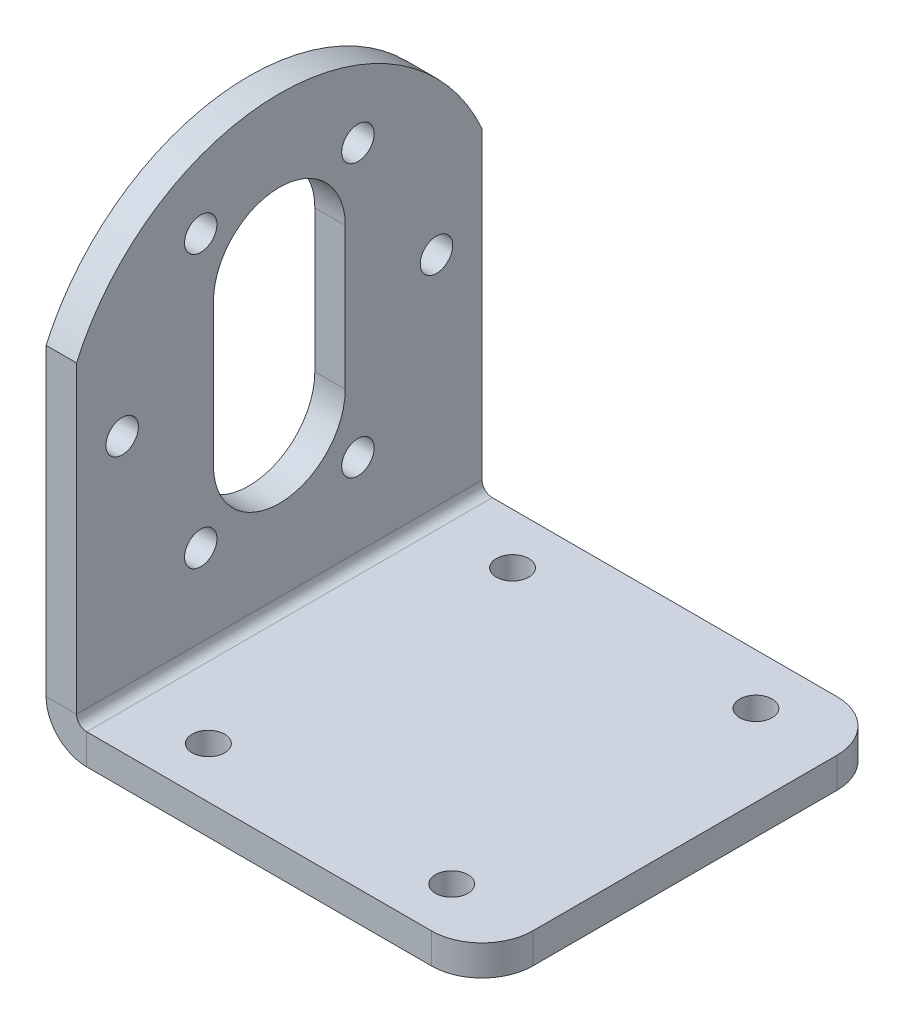
ISO-10303-21;
HEADER;
FILE_DESCRIPTION(('STEP AP214'),'2;1');
FILE_NAME('part.step','',(''),(''),'','','');
FILE_SCHEMA(('AUTOMOTIVE_DESIGN { 1 0 10303 214 1 1 1 1 }'));
ENDSEC;
DATA;
#1=APPLICATION_CONTEXT('core data for automotive mechanical design processes');
#2=APPLICATION_PROTOCOL_DEFINITION('international standard','automotive_design',2000,#1);
#3=PRODUCT_CONTEXT('',#1,'mechanical');
#4=PRODUCT('Part','Part','',(#3));
#5=PRODUCT_RELATED_PRODUCT_CATEGORY('part','',(#4));
#6=PRODUCT_DEFINITION_FORMATION('','',#4);
#7=PRODUCT_DEFINITION_CONTEXT('part definition',#1,'design');
#8=PRODUCT_DEFINITION('design','',#6,#7);
#9=PRODUCT_DEFINITION_SHAPE('','',#8);
#10=(LENGTH_UNIT() NAMED_UNIT(*) SI_UNIT(.MILLI.,.METRE.));
#11=(NAMED_UNIT(*) PLANE_ANGLE_UNIT() SI_UNIT($,.RADIAN.));
#12=(NAMED_UNIT(*) SI_UNIT($,.STERADIAN.) SOLID_ANGLE_UNIT());
#13=UNCERTAINTY_MEASURE_WITH_UNIT(LENGTH_MEASURE(1.E-05),#10,'distance_accuracy_value','');
#14=(GEOMETRIC_REPRESENTATION_CONTEXT(3) GLOBAL_UNCERTAINTY_ASSIGNED_CONTEXT((#13)) GLOBAL_UNIT_ASSIGNED_CONTEXT((#10,
#11,#12)) REPRESENTATION_CONTEXT('',''));
#15=CARTESIAN_POINT('',(0.,0.,0.));
#16=DIRECTION('',(0.,0.,1.));
#17=DIRECTION('',(1.,0.,0.));
#18=AXIS2_PLACEMENT_3D('',#15,#16,#17);
#19=CARTESIAN_POINT('',(7.99999999999999,44.,5.));
#20=DIRECTION('',(0.,-1.,0.));
#21=DIRECTION('',(0.,0.,-1.));
#22=AXIS2_PLACEMENT_3D('',#19,#20,#21);
#23=CYLINDRICAL_SURFACE('',#22,1.6);
#24=CARTESIAN_POINT('',(7.99999999999999,0.,5.));
#25=DIRECTION('',(0.,1.,0.));
#26=DIRECTION('',(0.,0.,1.));
#27=AXIS2_PLACEMENT_3D('',#24,#25,#26);
#28=CIRCLE('',#27,1.6);
#29=CARTESIAN_POINT('',(7.99999999999999,0.,6.6));
#30=VERTEX_POINT('',#29);
#31=EDGE_CURVE('E278',#30,#30,#28,.T.);
#32=ORIENTED_EDGE('',*,*,#31,.T.);
#33=EDGE_LOOP('',(#32));
#34=FACE_BOUND('',#33,.T.);
#35=CARTESIAN_POINT('',(7.99999999999999,-3.,5.));
#36=DIRECTION('',(0.,-1.,0.));
#37=DIRECTION('',(0.,0.,-1.));
#38=AXIS2_PLACEMENT_3D('',#35,#36,#37);
#39=CIRCLE('',#38,1.6);
#40=CARTESIAN_POINT('',(7.99999999999999,-3.,3.40000000000001));
#41=VERTEX_POINT('',#40);
#42=EDGE_CURVE('E281',#41,#41,#39,.T.);
#43=ORIENTED_EDGE('',*,*,#42,.T.);
#44=EDGE_LOOP('',(#43));
#45=FACE_BOUND('',#44,.T.);
#46=ADVANCED_FACE('F57',(#34,#45),#23,.F.);
#47=CARTESIAN_POINT('',(7.99999999999999,44.,35.));
#48=DIRECTION('',(0.,-1.,0.));
#49=DIRECTION('',(0.,0.,-1.));
#50=AXIS2_PLACEMENT_3D('',#47,#48,#49);
#51=CYLINDRICAL_SURFACE('',#50,1.6);
#52=CARTESIAN_POINT('',(7.99999999999999,0.,35.));
#53=DIRECTION('',(0.,1.,0.));
#54=DIRECTION('',(0.,0.,1.));
#55=AXIS2_PLACEMENT_3D('',#52,#53,#54);
#56=CIRCLE('',#55,1.6);
#57=CARTESIAN_POINT('',(7.99999999999999,0.,36.6));
#58=VERTEX_POINT('',#57);
#59=EDGE_CURVE('E267',#58,#58,#56,.T.);
#60=ORIENTED_EDGE('',*,*,#59,.T.);
#61=EDGE_LOOP('',(#60));
#62=FACE_BOUND('',#61,.T.);
#63=CARTESIAN_POINT('',(7.99999999999999,-3.,35.));
#64=DIRECTION('',(0.,-1.,0.));
#65=DIRECTION('',(0.,0.,-1.));
#66=AXIS2_PLACEMENT_3D('',#63,#64,#65);
#67=CIRCLE('',#66,1.6);
#68=CARTESIAN_POINT('',(7.99999999999999,-3.,33.4));
#69=VERTEX_POINT('',#68);
#70=EDGE_CURVE('E275',#69,#69,#67,.T.);
#71=ORIENTED_EDGE('',*,*,#70,.T.);
#72=EDGE_LOOP('',(#71));
#73=FACE_BOUND('',#72,.T.);
#74=ADVANCED_FACE('F363',(#62,#73),#51,.F.);
#75=CARTESIAN_POINT('',(0.,0.,40.));
#76=DIRECTION('',(1.,0.,0.));
#77=DIRECTION('',(0.,0.,-1.));
#78=AXIS2_PLACEMENT_3D('',#75,#76,#77);
#79=PLANE('',#78);
#80=CARTESIAN_POINT('',(0.,22.5,4.5));
#81=DIRECTION('',(1.,0.,0.));
#82=DIRECTION('',(0.,0.,-1.));
#83=AXIS2_PLACEMENT_3D('',#80,#81,#82);
#84=CIRCLE('',#83,1.6);
#85=CARTESIAN_POINT('',(0.,22.5,2.9));
#86=VERTEX_POINT('',#85);
#87=EDGE_CURVE('E680',#86,#86,#84,.T.);
#88=ORIENTED_EDGE('',*,*,#87,.F.);
#89=EDGE_LOOP('',(#88));
#90=FACE_BOUND('',#89,.T.);
#91=CARTESIAN_POINT('',(0.,35.9233937586588,12.25));
#92=DIRECTION('',(1.,0.,0.));
#93=DIRECTION('',(0.,0.,-1.));
#94=AXIS2_PLACEMENT_3D('',#91,#92,#93);
#95=CIRCLE('',#94,1.59999999999995);
#96=CARTESIAN_POINT('',(0.,35.9233937586588,10.6500000000001));
#97=VERTEX_POINT('',#96);
#98=EDGE_CURVE('E684',#97,#97,#95,.T.);
#99=ORIENTED_EDGE('',*,*,#98,.F.);
#100=EDGE_LOOP('',(#99));
#101=FACE_BOUND('',#100,.T.);
#102=CARTESIAN_POINT('',(0.,35.9233937586589,27.7499999999999));
#103=DIRECTION('',(1.,0.,0.));
#104=DIRECTION('',(0.,0.,-1.));
#105=AXIS2_PLACEMENT_3D('',#102,#103,#104);
#106=CIRCLE('',#105,1.6);
#107=CARTESIAN_POINT('',(0.,35.9233937586589,26.1499999999999));
#108=VERTEX_POINT('',#107);
#109=EDGE_CURVE('E688',#108,#108,#106,.T.);
#110=ORIENTED_EDGE('',*,*,#109,.F.);
#111=EDGE_LOOP('',(#110));
#112=FACE_BOUND('',#111,.T.);
#113=CARTESIAN_POINT('',(0.,22.5000000000001,35.5));
#114=DIRECTION('',(1.,0.,0.));
#115=DIRECTION('',(0.,0.,-1.));
#116=AXIS2_PLACEMENT_3D('',#113,#114,#115);
#117=CIRCLE('',#116,1.6);
#118=CARTESIAN_POINT('',(0.,22.5000000000001,33.9));
#119=VERTEX_POINT('',#118);
#120=EDGE_CURVE('E692',#119,#119,#117,.T.);
#121=ORIENTED_EDGE('',*,*,#120,.F.);
#122=EDGE_LOOP('',(#121));
#123=FACE_BOUND('',#122,.T.);
#124=CARTESIAN_POINT('',(0.,9.07660624134124,27.7500000000001));
#125=DIRECTION('',(1.,0.,0.));
#126=DIRECTION('',(0.,0.,-1.));
#127=AXIS2_PLACEMENT_3D('',#124,#125,#126);
#128=CIRCLE('',#127,1.6);
#129=CARTESIAN_POINT('',(0.,9.07660624134124,26.1500000000001));
#130=VERTEX_POINT('',#129);
#131=EDGE_CURVE('E696',#130,#130,#128,.T.);
#132=ORIENTED_EDGE('',*,*,#131,.F.);
#133=EDGE_LOOP('',(#132));
#134=FACE_BOUND('',#133,.T.);
#135=CARTESIAN_POINT('',(0.,9.07660624134118,12.25));
#136=DIRECTION('',(1.,0.,0.));
#137=DIRECTION('',(0.,0.,-1.));
#138=AXIS2_PLACEMENT_3D('',#135,#136,#137);
#139=CIRCLE('',#138,1.6);
#140=CARTESIAN_POINT('',(0.,9.07660624134118,10.65));
#141=VERTEX_POINT('',#140);
#142=EDGE_CURVE('E700',#141,#141,#139,.T.);
#143=ORIENTED_EDGE('',*,*,#142,.F.);
#144=EDGE_LOOP('',(#143));
#145=FACE_BOUND('',#144,.T.);
#146=CARTESIAN_POINT('',(0.,29.5,20.));
#147=DIRECTION('',(1.,0.,0.));
#148=DIRECTION('',(0.,0.,-1.));
#149=AXIS2_PLACEMENT_3D('',#146,#147,#148);
#150=CIRCLE('',#149,6.5);
#151=CARTESIAN_POINT('',(0.,29.5,13.5));
#152=VERTEX_POINT('',#151);
#153=CARTESIAN_POINT('',(0.,29.5,26.5));
#154=VERTEX_POINT('',#153);
#155=EDGE_CURVE('E200',#152,#154,#150,.T.);
#156=ORIENTED_EDGE('',*,*,#155,.F.);
#157=DIRECTION('',(0.,1.,0.));
#158=VECTOR('',#157,1.);
#159=CARTESIAN_POINT('',(0.,0.,13.5));
#160=LINE('',#159,#158);
#161=CARTESIAN_POINT('',(0.,15.5,13.5));
#162=VERTEX_POINT('',#161);
#163=EDGE_CURVE('E193',#162,#152,#160,.T.);
#164=ORIENTED_EDGE('',*,*,#163,.F.);
#165=CARTESIAN_POINT('',(0.,15.5,20.));
#166=DIRECTION('',(1.,0.,0.));
#167=DIRECTION('',(0.,0.,-1.));
#168=AXIS2_PLACEMENT_3D('',#165,#166,#167);
#169=CIRCLE('',#168,6.5);
#170=CARTESIAN_POINT('',(0.,15.5,26.5));
#171=VERTEX_POINT('',#170);
#172=EDGE_CURVE('E168',#171,#162,#169,.T.);
#173=ORIENTED_EDGE('',*,*,#172,.F.);
#174=DIRECTION('',(0.,-1.,0.));
#175=VECTOR('',#174,1.);
#176=CARTESIAN_POINT('',(0.,0.,26.5));
#177=LINE('',#176,#175);
#178=EDGE_CURVE('E198',#154,#171,#177,.T.);
#179=ORIENTED_EDGE('',*,*,#178,.F.);
#180=EDGE_LOOP('',(#156,#164,#173,#179));
#181=FACE_BOUND('',#180,.T.);
#182=CARTESIAN_POINT('',(0.,22.1134778286727,20.));
#183=DIRECTION('',(1.,0.,0.));
#184=DIRECTION('',(0.,0.,-1.));
#185=AXIS2_PLACEMENT_3D('',#182,#183,#184);
#186=CIRCLE('',#185,21.8865221713273);
#187=CARTESIAN_POINT('',(0.,31.0027889806126,40.));
#188=VERTEX_POINT('',#187);
#189=CARTESIAN_POINT('',(0.,31.0027889806126,0.));
#190=VERTEX_POINT('',#189);
#191=EDGE_CURVE('E206',#188,#190,#186,.F.);
#192=ORIENTED_EDGE('',*,*,#191,.F.);
#193=DIRECTION('',(0.,-1.,0.));
#194=VECTOR('',#193,1.);
#195=CARTESIAN_POINT('',(0.,0.,40.));
#196=LINE('',#195,#194);
#197=CARTESIAN_POINT('',(0.,1.,40.));
#198=VERTEX_POINT('',#197);
#199=EDGE_CURVE('E217',#188,#198,#196,.T.);
#200=ORIENTED_EDGE('',*,*,#199,.T.);
#201=DIRECTION('',(0.,0.,-1.));
#202=VECTOR('',#201,1.);
#203=CARTESIAN_POINT('',(0.,1.,40.));
#204=LINE('',#203,#202);
#205=CARTESIAN_POINT('',(0.,1.,0.));
#206=VERTEX_POINT('',#205);
#207=EDGE_CURVE('E244',#198,#206,#204,.T.);
#208=ORIENTED_EDGE('',*,*,#207,.T.);
#209=DIRECTION('',(0.,-1.,0.));
#210=VECTOR('',#209,1.);
#211=CARTESIAN_POINT('',(0.,0.,0.));
#212=LINE('',#211,#210);
#213=EDGE_CURVE('E233',#190,#206,#212,.T.);
#214=ORIENTED_EDGE('',*,*,#213,.F.);
#215=EDGE_LOOP('',(#192,#200,#208,#214));
#216=FACE_BOUND('',#215,.T.);
#217=ADVANCED_FACE('F337',(#90,#101,#112,#123,#134,#145,#181,#216),#79,.T.);
#218=CARTESIAN_POINT('',(-3.,0.,40.));
#219=DIRECTION('',(1.,0.,0.));
#220=DIRECTION('',(0.,0.,-1.));
#221=AXIS2_PLACEMENT_3D('',#218,#219,#220);
#222=PLANE('',#221);
#223=CARTESIAN_POINT('',(-3.,22.5,4.5));
#224=DIRECTION('',(-1.,0.,0.));
#225=DIRECTION('',(0.,0.,1.));
#226=AXIS2_PLACEMENT_3D('',#223,#224,#225);
#227=CIRCLE('',#226,1.6);
#228=CARTESIAN_POINT('',(-3.,22.5,6.1));
#229=VERTEX_POINT('',#228);
#230=EDGE_CURVE('E711',#229,#229,#227,.T.);
#231=ORIENTED_EDGE('',*,*,#230,.F.);
#232=EDGE_LOOP('',(#231));
#233=FACE_BOUND('',#232,.T.);
#234=CARTESIAN_POINT('',(-3.,35.9233937586588,12.25));
#235=DIRECTION('',(-1.,0.,0.));
#236=DIRECTION('',(0.,0.,1.));
#237=AXIS2_PLACEMENT_3D('',#234,#235,#236);
#238=CIRCLE('',#237,1.59999999999995);
#239=CARTESIAN_POINT('',(-3.,35.9233937586588,13.85));
#240=VERTEX_POINT('',#239);
#241=EDGE_CURVE('E271',#240,#240,#238,.T.);
#242=ORIENTED_EDGE('',*,*,#241,.F.);
#243=EDGE_LOOP('',(#242));
#244=FACE_BOUND('',#243,.T.);
#245=CARTESIAN_POINT('',(-3.,35.9233937586589,27.7499999999999));
#246=DIRECTION('',(-1.,0.,0.));
#247=DIRECTION('',(0.,0.,1.));
#248=AXIS2_PLACEMENT_3D('',#245,#246,#247);
#249=CIRCLE('',#248,1.6);
#250=CARTESIAN_POINT('',(-3.,35.9233937586589,29.3499999999999));
#251=VERTEX_POINT('',#250);
#252=EDGE_CURVE('E712',#251,#251,#249,.T.);
#253=ORIENTED_EDGE('',*,*,#252,.F.);
#254=EDGE_LOOP('',(#253));
#255=FACE_BOUND('',#254,.T.);
#256=CARTESIAN_POINT('',(-3.,22.5000000000001,35.5));
#257=DIRECTION('',(-1.,0.,0.));
#258=DIRECTION('',(0.,0.,1.));
#259=AXIS2_PLACEMENT_3D('',#256,#257,#258);
#260=CIRCLE('',#259,1.6);
#261=CARTESIAN_POINT('',(-3.,22.5000000000001,37.1));
#262=VERTEX_POINT('',#261);
#263=EDGE_CURVE('E715',#262,#262,#260,.T.);
#264=ORIENTED_EDGE('',*,*,#263,.F.);
#265=EDGE_LOOP('',(#264));
#266=FACE_BOUND('',#265,.T.);
#267=CARTESIAN_POINT('',(-3.,9.07660624134124,27.7500000000001));
#268=DIRECTION('',(-1.,0.,0.));
#269=DIRECTION('',(0.,0.,1.));
#270=AXIS2_PLACEMENT_3D('',#267,#268,#269);
#271=CIRCLE('',#270,1.6);
#272=CARTESIAN_POINT('',(-3.,9.07660624134124,29.3500000000001));
#273=VERTEX_POINT('',#272);
#274=EDGE_CURVE('E718',#273,#273,#271,.T.);
#275=ORIENTED_EDGE('',*,*,#274,.F.);
#276=EDGE_LOOP('',(#275));
#277=FACE_BOUND('',#276,.T.);
#278=CARTESIAN_POINT('',(-3.,9.07660624134118,12.25));
#279=DIRECTION('',(-1.,0.,0.));
#280=DIRECTION('',(0.,0.,1.));
#281=AXIS2_PLACEMENT_3D('',#278,#279,#280);
#282=CIRCLE('',#281,1.6);
#283=CARTESIAN_POINT('',(-3.,9.07660624134118,13.85));
#284=VERTEX_POINT('',#283);
#285=EDGE_CURVE('E721',#284,#284,#282,.T.);
#286=ORIENTED_EDGE('',*,*,#285,.F.);
#287=EDGE_LOOP('',(#286));
#288=FACE_BOUND('',#287,.T.);
#289=DIRECTION('',(0.,-1.,0.));
#290=VECTOR('',#289,1.);
#291=CARTESIAN_POINT('',(-3.,29.5,13.5));
#292=LINE('',#291,#290);
#293=CARTESIAN_POINT('',(-3.,29.5,13.5));
#294=VERTEX_POINT('',#293);
#295=CARTESIAN_POINT('',(-3.,15.5,13.5));
#296=VERTEX_POINT('',#295);
#297=EDGE_CURVE('E176',#294,#296,#292,.T.);
#298=ORIENTED_EDGE('',*,*,#297,.F.);
#299=CARTESIAN_POINT('',(-3.,29.5,20.));
#300=DIRECTION('',(-1.,0.,0.));
#301=DIRECTION('',(0.,0.,1.));
#302=AXIS2_PLACEMENT_3D('',#299,#300,#301);
#303=CIRCLE('',#302,6.5);
#304=CARTESIAN_POINT('',(-3.,29.5,26.5));
#305=VERTEX_POINT('',#304);
#306=EDGE_CURVE('E181',#305,#294,#303,.T.);
#307=ORIENTED_EDGE('',*,*,#306,.F.);
#308=DIRECTION('',(0.,1.,0.));
#309=VECTOR('',#308,1.);
#310=CARTESIAN_POINT('',(-3.,29.5,26.5));
#311=LINE('',#310,#309);
#312=CARTESIAN_POINT('',(-3.,15.5,26.5));
#313=VERTEX_POINT('',#312);
#314=EDGE_CURVE('E186',#313,#305,#311,.T.);
#315=ORIENTED_EDGE('',*,*,#314,.F.);
#316=CARTESIAN_POINT('',(-3.,15.5,20.));
#317=DIRECTION('',(-1.,0.,0.));
#318=DIRECTION('',(0.,0.,1.));
#319=AXIS2_PLACEMENT_3D('',#316,#317,#318);
#320=CIRCLE('',#319,6.5);
#321=EDGE_CURVE('E165',#296,#313,#320,.T.);
#322=ORIENTED_EDGE('',*,*,#321,.F.);
#323=EDGE_LOOP('',(#298,#307,#315,#322));
#324=FACE_BOUND('',#323,.T.);
#325=DIRECTION('',(0.,1.,0.));
#326=VECTOR('',#325,1.);
#327=CARTESIAN_POINT('',(-3.,0.,40.));
#328=LINE('',#327,#326);
#329=CARTESIAN_POINT('',(-3.,31.0027889806126,40.));
#330=VERTEX_POINT('',#329);
#331=CARTESIAN_POINT('',(-3.,1.,40.));
#332=VERTEX_POINT('',#331);
#333=EDGE_CURVE('E219',#330,#332,#328,.F.);
#334=ORIENTED_EDGE('',*,*,#333,.F.);
#335=CARTESIAN_POINT('',(-3.,22.1134778286727,20.));
#336=DIRECTION('',(-1.,0.,0.));
#337=DIRECTION('',(0.,0.,1.));
#338=AXIS2_PLACEMENT_3D('',#335,#336,#337);
#339=CIRCLE('',#338,21.8865221713273);
#340=CARTESIAN_POINT('',(-3.,31.0027889806126,0.));
#341=VERTEX_POINT('',#340);
#342=EDGE_CURVE('E202',#341,#330,#339,.F.);
#343=ORIENTED_EDGE('',*,*,#342,.F.);
#344=DIRECTION('',(0.,1.,0.));
#345=VECTOR('',#344,1.);
#346=CARTESIAN_POINT('',(-3.,0.,0.));
#347=LINE('',#346,#345);
#348=CARTESIAN_POINT('',(-3.,1.,0.));
#349=VERTEX_POINT('',#348);
#350=EDGE_CURVE('E235',#341,#349,#347,.F.);
#351=ORIENTED_EDGE('',*,*,#350,.T.);
#352=DIRECTION('',(0.,0.,-1.));
#353=VECTOR('',#352,1.);
#354=CARTESIAN_POINT('',(-3.,1.,40.));
#355=LINE('',#354,#353);
#356=EDGE_CURVE('E241',#332,#349,#355,.T.);
#357=ORIENTED_EDGE('',*,*,#356,.F.);
#358=EDGE_LOOP('',(#334,#343,#351,#357));
#359=FACE_BOUND('',#358,.T.);
#360=ADVANCED_FACE('F183',(#233,#244,#255,#266,#277,#288,#324,#359),#222,.F.);
#361=CARTESIAN_POINT('',(1.,0.,40.));
#362=DIRECTION('',(0.,0.,1.));
#363=DIRECTION('',(1.,0.,0.));
#364=AXIS2_PLACEMENT_3D('',#361,#362,#363);
#365=PLANE('',#364);
#366=DIRECTION('',(0.,-1.,0.));
#367=VECTOR('',#366,1.);
#368=CARTESIAN_POINT('',(1.,0.,40.));
#369=LINE('',#368,#367);
#370=CARTESIAN_POINT('',(1.,0.,40.));
#371=VERTEX_POINT('',#370);
#372=CARTESIAN_POINT('',(1.,-3.,40.));
#373=VERTEX_POINT('',#372);
#374=EDGE_CURVE('E262',#371,#373,#369,.T.);
#375=ORIENTED_EDGE('',*,*,#374,.F.);
#376=CARTESIAN_POINT('',(1.,1.,40.));
#377=DIRECTION('',(0.,0.,-1.));
#378=DIRECTION('',(-1.,0.,0.));
#379=AXIS2_PLACEMENT_3D('',#376,#377,#378);
#380=CIRCLE('',#379,1.);
#381=EDGE_CURVE('E214',#198,#371,#380,.F.);
#382=ORIENTED_EDGE('',*,*,#381,.F.);
#383=DIRECTION('',(1.,0.,0.));
#384=VECTOR('',#383,1.);
#385=CARTESIAN_POINT('',(-3.,1.,40.));
#386=LINE('',#385,#384);
#387=EDGE_CURVE('E259',#332,#198,#386,.T.);
#388=ORIENTED_EDGE('',*,*,#387,.F.);
#389=CARTESIAN_POINT('',(1.,1.,40.));
#390=DIRECTION('',(0.,0.,1.));
#391=DIRECTION('',(1.,0.,0.));
#392=AXIS2_PLACEMENT_3D('',#389,#390,#391);
#393=CIRCLE('',#392,4.);
#394=EDGE_CURVE('E221',#332,#373,#393,.T.);
#395=ORIENTED_EDGE('',*,*,#394,.T.);
#396=EDGE_LOOP('',(#375,#382,#388,#395));
#397=FACE_BOUND('',#396,.T.);
#398=ADVANCED_FACE('F323',(#397),#365,.T.);
#399=CARTESIAN_POINT('',(-3.,1.,40.));
#400=DIRECTION('',(0.,0.,1.));
#401=DIRECTION('',(1.,0.,0.));
#402=AXIS2_PLACEMENT_3D('',#399,#400,#401);
#403=PLANE('',#402);
#404=DIRECTION('',(1.,0.,0.));
#405=VECTOR('',#404,1.);
#406=CARTESIAN_POINT('',(0.,-3.,40.));
#407=LINE('',#406,#405);
#408=CARTESIAN_POINT('',(35.,-3.,40.));
#409=VERTEX_POINT('',#408);
#410=EDGE_CURVE('E209',#373,#409,#407,.T.);
#411=ORIENTED_EDGE('',*,*,#410,.T.);
#412=DIRECTION('',(0.,-1.,0.));
#413=VECTOR('',#412,1.);
#414=CARTESIAN_POINT('',(35.,1.,40.));
#415=LINE('',#414,#413);
#416=CARTESIAN_POINT('',(35.,0.,40.));
#417=VERTEX_POINT('',#416);
#418=EDGE_CURVE('E12',#409,#417,#415,.F.);
#419=ORIENTED_EDGE('',*,*,#418,.T.);
#420=DIRECTION('',(1.,0.,0.));
#421=VECTOR('',#420,1.);
#422=CARTESIAN_POINT('',(0.,0.,40.));
#423=LINE('',#422,#421);
#424=EDGE_CURVE('E211',#371,#417,#423,.T.);
#425=ORIENTED_EDGE('',*,*,#424,.F.);
#426=ORIENTED_EDGE('',*,*,#374,.T.);
#427=EDGE_LOOP('',(#411,#419,#425,#426));
#428=FACE_BOUND('',#427,.T.);
#429=ADVANCED_FACE('F317',(#428),#403,.T.);
#430=CARTESIAN_POINT('',(0.,1.,0.));
#431=DIRECTION('',(0.,0.,-1.));
#432=DIRECTION('',(-1.,0.,0.));
#433=AXIS2_PLACEMENT_3D('',#430,#431,#432);
#434=PLANE('',#433);
#435=DIRECTION('',(-1.,0.,0.));
#436=VECTOR('',#435,1.);
#437=CARTESIAN_POINT('',(0.,1.,0.));
#438=LINE('',#437,#436);
#439=EDGE_CURVE('E256',#206,#349,#438,.T.);
#440=ORIENTED_EDGE('',*,*,#439,.F.);
#441=CARTESIAN_POINT('',(1.,1.,0.));
#442=DIRECTION('',(0.,0.,-1.));
#443=DIRECTION('',(-1.,0.,0.));
#444=AXIS2_PLACEMENT_3D('',#441,#442,#443);
#445=CIRCLE('',#444,1.);
#446=CARTESIAN_POINT('',(1.,0.,0.));
#447=VERTEX_POINT('',#446);
#448=EDGE_CURVE('E230',#206,#447,#445,.F.);
#449=ORIENTED_EDGE('',*,*,#448,.T.);
#450=DIRECTION('',(0.,1.,0.));
#451=VECTOR('',#450,1.);
#452=CARTESIAN_POINT('',(1.,-3.,0.));
#453=LINE('',#452,#451);
#454=CARTESIAN_POINT('',(1.,-3.,0.));
#455=VERTEX_POINT('',#454);
#456=EDGE_CURVE('E254',#455,#447,#453,.T.);
#457=ORIENTED_EDGE('',*,*,#456,.F.);
#458=CARTESIAN_POINT('',(1.,1.,0.));
#459=DIRECTION('',(0.,0.,1.));
#460=DIRECTION('',(1.,0.,0.));
#461=AXIS2_PLACEMENT_3D('',#458,#459,#460);
#462=CIRCLE('',#461,4.);
#463=EDGE_CURVE('E212',#349,#455,#462,.T.);
#464=ORIENTED_EDGE('',*,*,#463,.F.);
#465=EDGE_LOOP('',(#440,#449,#457,#464));
#466=FACE_BOUND('',#465,.T.);
#467=ADVANCED_FACE('F330',(#466),#434,.T.);
#468=CARTESIAN_POINT('',(1.,-3.,0.));
#469=DIRECTION('',(0.,0.,-1.));
#470=DIRECTION('',(-1.,0.,0.));
#471=AXIS2_PLACEMENT_3D('',#468,#469,#470);
#472=PLANE('',#471);
#473=DIRECTION('',(-1.,0.,0.));
#474=VECTOR('',#473,1.);
#475=CARTESIAN_POINT('',(7.,31.0027889806126,0.));
#476=LINE('',#475,#474);
#477=EDGE_CURVE('E204',#190,#341,#476,.T.);
#478=ORIENTED_EDGE('',*,*,#477,.F.);
#479=ORIENTED_EDGE('',*,*,#213,.T.);
#480=ORIENTED_EDGE('',*,*,#439,.T.);
#481=ORIENTED_EDGE('',*,*,#350,.F.);
#482=EDGE_LOOP('',(#478,#479,#480,#481));
#483=FACE_BOUND('',#482,.T.);
#484=ADVANCED_FACE('F347',(#483),#472,.T.);
#485=CARTESIAN_POINT('',(0.,-3.,40.));
#486=DIRECTION('',(0.,1.,0.));
#487=DIRECTION('',(0.,0.,1.));
#488=AXIS2_PLACEMENT_3D('',#485,#486,#487);
#489=PLANE('',#488);
#490=CARTESIAN_POINT('',(32.,-3.,5.));
#491=DIRECTION('',(0.,-1.,0.));
#492=DIRECTION('',(0.,0.,-1.));
#493=AXIS2_PLACEMENT_3D('',#490,#491,#492);
#494=CIRCLE('',#493,1.6);
#495=CARTESIAN_POINT('',(32.,-3.,3.40000000000001));
#496=VERTEX_POINT('',#495);
#497=EDGE_CURVE('E730',#496,#496,#494,.T.);
#498=ORIENTED_EDGE('',*,*,#497,.F.);
#499=EDGE_LOOP('',(#498));
#500=FACE_BOUND('',#499,.T.);
#501=CARTESIAN_POINT('',(32.,-3.,35.));
#502=DIRECTION('',(0.,-1.,0.));
#503=DIRECTION('',(0.,0.,-1.));
#504=AXIS2_PLACEMENT_3D('',#501,#502,#503);
#505=CIRCLE('',#504,1.6);
#506=CARTESIAN_POINT('',(32.,-3.,33.4));
#507=VERTEX_POINT('',#506);
#508=EDGE_CURVE('E272',#507,#507,#505,.T.);
#509=ORIENTED_EDGE('',*,*,#508,.F.);
#510=EDGE_LOOP('',(#509));
#511=FACE_BOUND('',#510,.T.);
#512=DIRECTION('',(1.,0.,0.));
#513=VECTOR('',#512,1.);
#514=CARTESIAN_POINT('',(0.,-3.,0.));
#515=LINE('',#514,#513);
#516=CARTESIAN_POINT('',(35.,-3.,0.));
#517=VERTEX_POINT('',#516);
#518=EDGE_CURVE('E208',#455,#517,#515,.T.);
#519=ORIENTED_EDGE('',*,*,#518,.T.);
#520=CARTESIAN_POINT('',(35.,-3.,5.));
#521=DIRECTION('',(0.,1.,0.));
#522=DIRECTION('',(0.,0.,1.));
#523=AXIS2_PLACEMENT_3D('',#520,#521,#522);
#524=CIRCLE('',#523,5.);
#525=CARTESIAN_POINT('',(40.,-3.,5.));
#526=VERTEX_POINT('',#525);
#527=EDGE_CURVE('E289',#517,#526,#524,.F.);
#528=ORIENTED_EDGE('',*,*,#527,.T.);
#529=DIRECTION('',(0.,0.,-1.));
#530=VECTOR('',#529,1.);
#531=CARTESIAN_POINT('',(40.,-3.,40.));
#532=LINE('',#531,#530);
#533=CARTESIAN_POINT('',(40.,-3.,35.));
#534=VERTEX_POINT('',#533);
#535=EDGE_CURVE('E252',#534,#526,#532,.T.);
#536=ORIENTED_EDGE('',*,*,#535,.F.);
#537=CARTESIAN_POINT('',(35.,-3.,35.));
#538=DIRECTION('',(0.,1.,0.));
#539=DIRECTION('',(0.,0.,1.));
#540=AXIS2_PLACEMENT_3D('',#537,#538,#539);
#541=CIRCLE('',#540,5.);
#542=EDGE_CURVE('E287',#534,#409,#541,.F.);
#543=ORIENTED_EDGE('',*,*,#542,.T.);
#544=ORIENTED_EDGE('',*,*,#410,.F.);
#545=DIRECTION('',(0.,0.,-1.));
#546=VECTOR('',#545,1.);
#547=CARTESIAN_POINT('',(1.,-3.,40.));
#548=LINE('',#547,#546);
#549=EDGE_CURVE('E224',#373,#455,#548,.T.);
#550=ORIENTED_EDGE('',*,*,#549,.T.);
#551=EDGE_LOOP('',(#519,#528,#536,#543,#544,#550));
#552=FACE_BOUND('',#551,.T.);
#553=ORIENTED_EDGE('',*,*,#70,.F.);
#554=EDGE_LOOP('',(#553));
#555=FACE_BOUND('',#554,.T.);
#556=ORIENTED_EDGE('',*,*,#42,.F.);
#557=EDGE_LOOP('',(#556));
#558=FACE_BOUND('',#557,.T.);
#559=ADVANCED_FACE('F310',(#500,#511,#552,#555,#558),#489,.F.);
#560=CARTESIAN_POINT('',(40.,0.,40.));
#561=DIRECTION('',(1.,0.,0.));
#562=DIRECTION('',(0.,0.,-1.));
#563=AXIS2_PLACEMENT_3D('',#560,#561,#562);
#564=PLANE('',#563);
#565=ORIENTED_EDGE('',*,*,#535,.T.);
#566=DIRECTION('',(0.,-1.,0.));
#567=VECTOR('',#566,1.);
#568=CARTESIAN_POINT('',(40.,0.,5.));
#569=LINE('',#568,#567);
#570=CARTESIAN_POINT('',(40.,0.,5.));
#571=VERTEX_POINT('',#570);
#572=EDGE_CURVE('E78',#526,#571,#569,.F.);
#573=ORIENTED_EDGE('',*,*,#572,.T.);
#574=DIRECTION('',(0.,0.,-1.));
#575=VECTOR('',#574,1.);
#576=CARTESIAN_POINT('',(40.,0.,40.));
#577=LINE('',#576,#575);
#578=CARTESIAN_POINT('',(40.,0.,35.));
#579=VERTEX_POINT('',#578);
#580=EDGE_CURVE('E250',#579,#571,#577,.T.);
#581=ORIENTED_EDGE('',*,*,#580,.F.);
#582=DIRECTION('',(0.,-1.,0.));
#583=VECTOR('',#582,1.);
#584=CARTESIAN_POINT('',(40.,0.,35.));
#585=LINE('',#584,#583);
#586=EDGE_CURVE('E291',#579,#534,#585,.T.);
#587=ORIENTED_EDGE('',*,*,#586,.T.);
#588=EDGE_LOOP('',(#565,#573,#581,#587));
#589=FACE_BOUND('',#588,.T.);
#590=ADVANCED_FACE('F312',(#589),#564,.T.);
#591=CARTESIAN_POINT('',(0.,0.,40.));
#592=DIRECTION('',(0.,1.,0.));
#593=DIRECTION('',(0.,0.,1.));
#594=AXIS2_PLACEMENT_3D('',#591,#592,#593);
#595=PLANE('',#594);
#596=CARTESIAN_POINT('',(32.,0.,5.));
#597=DIRECTION('',(0.,1.,0.));
#598=DIRECTION('',(0.,0.,1.));
#599=AXIS2_PLACEMENT_3D('',#596,#597,#598);
#600=CIRCLE('',#599,1.6);
#601=CARTESIAN_POINT('',(32.,0.,6.6));
#602=VERTEX_POINT('',#601);
#603=EDGE_CURVE('E733',#602,#602,#600,.T.);
#604=ORIENTED_EDGE('',*,*,#603,.F.);
#605=EDGE_LOOP('',(#604));
#606=FACE_BOUND('',#605,.T.);
#607=CARTESIAN_POINT('',(32.,0.,35.));
#608=DIRECTION('',(0.,1.,0.));
#609=DIRECTION('',(0.,0.,1.));
#610=AXIS2_PLACEMENT_3D('',#607,#608,#609);
#611=CIRCLE('',#610,1.6);
#612=CARTESIAN_POINT('',(32.,0.,36.6));
#613=VERTEX_POINT('',#612);
#614=EDGE_CURVE('E268',#613,#613,#611,.T.);
#615=ORIENTED_EDGE('',*,*,#614,.F.);
#616=EDGE_LOOP('',(#615));
#617=FACE_BOUND('',#616,.T.);
#618=ORIENTED_EDGE('',*,*,#580,.T.);
#619=CARTESIAN_POINT('',(35.,0.,5.));
#620=DIRECTION('',(0.,1.,0.));
#621=DIRECTION('',(0.,0.,1.));
#622=AXIS2_PLACEMENT_3D('',#619,#620,#621);
#623=CIRCLE('',#622,5.);
#624=CARTESIAN_POINT('',(35.,0.,0.));
#625=VERTEX_POINT('',#624);
#626=EDGE_CURVE('E65',#571,#625,#623,.T.);
#627=ORIENTED_EDGE('',*,*,#626,.T.);
#628=DIRECTION('',(1.,0.,0.));
#629=VECTOR('',#628,1.);
#630=CARTESIAN_POINT('',(0.,0.,0.));
#631=LINE('',#630,#629);
#632=EDGE_CURVE('E227',#447,#625,#631,.T.);
#633=ORIENTED_EDGE('',*,*,#632,.F.);
#634=DIRECTION('',(0.,0.,-1.));
#635=VECTOR('',#634,1.);
#636=CARTESIAN_POINT('',(1.,0.,40.));
#637=LINE('',#636,#635);
#638=EDGE_CURVE('E247',#371,#447,#637,.T.);
#639=ORIENTED_EDGE('',*,*,#638,.F.);
#640=ORIENTED_EDGE('',*,*,#424,.T.);
#641=CARTESIAN_POINT('',(35.,0.,35.));
#642=DIRECTION('',(0.,1.,0.));
#643=DIRECTION('',(0.,0.,1.));
#644=AXIS2_PLACEMENT_3D('',#641,#642,#643);
#645=CIRCLE('',#644,5.);
#646=EDGE_CURVE('E295',#417,#579,#645,.T.);
#647=ORIENTED_EDGE('',*,*,#646,.T.);
#648=EDGE_LOOP('',(#618,#627,#633,#639,#640,#647));
#649=FACE_BOUND('',#648,.T.);
#650=ORIENTED_EDGE('',*,*,#59,.F.);
#651=EDGE_LOOP('',(#650));
#652=FACE_BOUND('',#651,.T.);
#653=ORIENTED_EDGE('',*,*,#31,.F.);
#654=EDGE_LOOP('',(#653));
#655=FACE_BOUND('',#654,.T.);
#656=ADVANCED_FACE('F299',(#606,#617,#649,#652,#655),#595,.T.);
#657=CARTESIAN_POINT('',(1.,1.,40.));
#658=DIRECTION('',(0.,0.,-1.));
#659=DIRECTION('',(-1.,0.,0.));
#660=AXIS2_PLACEMENT_3D('',#657,#658,#659);
#661=CYLINDRICAL_SURFACE('',#660,1.);
#662=ORIENTED_EDGE('',*,*,#448,.F.);
#663=ORIENTED_EDGE('',*,*,#207,.F.);
#664=ORIENTED_EDGE('',*,*,#381,.T.);
#665=ORIENTED_EDGE('',*,*,#638,.T.);
#666=EDGE_LOOP('',(#662,#663,#664,#665));
#667=FACE_BOUND('',#666,.T.);
#668=ADVANCED_FACE('F334',(#667),#661,.F.);
#669=CARTESIAN_POINT('',(1.,1.,40.));
#670=DIRECTION('',(0.,0.,-1.));
#671=DIRECTION('',(-1.,0.,0.));
#672=AXIS2_PLACEMENT_3D('',#669,#670,#671);
#673=CYLINDRICAL_SURFACE('',#672,4.);
#674=ORIENTED_EDGE('',*,*,#463,.T.);
#675=ORIENTED_EDGE('',*,*,#549,.F.);
#676=ORIENTED_EDGE('',*,*,#394,.F.);
#677=ORIENTED_EDGE('',*,*,#356,.T.);
#678=EDGE_LOOP('',(#674,#675,#676,#677));
#679=FACE_BOUND('',#678,.T.);
#680=ADVANCED_FACE('F326',(#679),#673,.T.);
#681=CARTESIAN_POINT('',(1.,1.,40.));
#682=DIRECTION('',(0.,0.,-1.));
#683=DIRECTION('',(-1.,0.,0.));
#684=AXIS2_PLACEMENT_3D('',#681,#682,#683);
#685=PLANE('',#684);
#686=ORIENTED_EDGE('',*,*,#199,.F.);
#687=DIRECTION('',(-1.,0.,0.));
#688=VECTOR('',#687,1.);
#689=CARTESIAN_POINT('',(7.,31.0027889806126,40.));
#690=LINE('',#689,#688);
#691=EDGE_CURVE('E264',#188,#330,#690,.T.);
#692=ORIENTED_EDGE('',*,*,#691,.T.);
#693=ORIENTED_EDGE('',*,*,#333,.T.);
#694=ORIENTED_EDGE('',*,*,#387,.T.);
#695=EDGE_LOOP('',(#686,#692,#693,#694));
#696=FACE_BOUND('',#695,.T.);
#697=ADVANCED_FACE('F341',(#696),#685,.F.);
#698=CARTESIAN_POINT('',(1.,1.,0.));
#699=DIRECTION('',(0.,0.,-1.));
#700=DIRECTION('',(-1.,0.,0.));
#701=AXIS2_PLACEMENT_3D('',#698,#699,#700);
#702=PLANE('',#701);
#703=ORIENTED_EDGE('',*,*,#632,.T.);
#704=DIRECTION('',(0.,-1.,0.));
#705=VECTOR('',#704,1.);
#706=CARTESIAN_POINT('',(35.,1.,0.));
#707=LINE('',#706,#705);
#708=EDGE_CURVE('E284',#625,#517,#707,.T.);
#709=ORIENTED_EDGE('',*,*,#708,.T.);
#710=ORIENTED_EDGE('',*,*,#518,.F.);
#711=ORIENTED_EDGE('',*,*,#456,.T.);
#712=EDGE_LOOP('',(#703,#709,#710,#711));
#713=FACE_BOUND('',#712,.T.);
#714=ADVANCED_FACE('F305',(#713),#702,.T.);
#715=CARTESIAN_POINT('',(7.,22.1134778286727,20.));
#716=DIRECTION('',(-1.,0.,0.));
#717=DIRECTION('',(0.,0.,1.));
#718=AXIS2_PLACEMENT_3D('',#715,#716,#717);
#719=CYLINDRICAL_SURFACE('',#718,21.8865221713273);
#720=ORIENTED_EDGE('',*,*,#191,.T.);
#721=ORIENTED_EDGE('',*,*,#477,.T.);
#722=ORIENTED_EDGE('',*,*,#342,.T.);
#723=ORIENTED_EDGE('',*,*,#691,.F.);
#724=EDGE_LOOP('',(#720,#721,#722,#723));
#725=FACE_BOUND('',#724,.T.);
#726=ADVANCED_FACE('F349',(#725),#719,.T.);
#727=CARTESIAN_POINT('',(40.,29.5,20.));
#728=DIRECTION('',(-1.,0.,0.));
#729=DIRECTION('',(0.,0.,1.));
#730=AXIS2_PLACEMENT_3D('',#727,#728,#729);
#731=CYLINDRICAL_SURFACE('',#730,6.5);
#732=ORIENTED_EDGE('',*,*,#155,.T.);
#733=DIRECTION('',(-1.,0.,0.));
#734=VECTOR('',#733,1.);
#735=CARTESIAN_POINT('',(40.,29.5,26.5));
#736=LINE('',#735,#734);
#737=EDGE_CURVE('E191',#154,#305,#736,.T.);
#738=ORIENTED_EDGE('',*,*,#737,.T.);
#739=ORIENTED_EDGE('',*,*,#306,.T.);
#740=DIRECTION('',(-1.,0.,0.));
#741=VECTOR('',#740,1.);
#742=CARTESIAN_POINT('',(40.,29.5,13.5));
#743=LINE('',#742,#741);
#744=EDGE_CURVE('E172',#152,#294,#743,.T.);
#745=ORIENTED_EDGE('',*,*,#744,.F.);
#746=EDGE_LOOP('',(#732,#738,#739,#745));
#747=FACE_BOUND('',#746,.T.);
#748=ADVANCED_FACE('F351',(#747),#731,.F.);
#749=CARTESIAN_POINT('',(40.,29.5,26.5));
#750=DIRECTION('',(0.,0.,1.));
#751=DIRECTION('',(1.,0.,0.));
#752=AXIS2_PLACEMENT_3D('',#749,#750,#751);
#753=PLANE('',#752);
#754=ORIENTED_EDGE('',*,*,#178,.T.);
#755=DIRECTION('',(-1.,0.,0.));
#756=VECTOR('',#755,1.);
#757=CARTESIAN_POINT('',(40.,15.5,26.5));
#758=LINE('',#757,#756);
#759=EDGE_CURVE('E171',#171,#313,#758,.T.);
#760=ORIENTED_EDGE('',*,*,#759,.T.);
#761=ORIENTED_EDGE('',*,*,#314,.T.);
#762=ORIENTED_EDGE('',*,*,#737,.F.);
#763=EDGE_LOOP('',(#754,#760,#761,#762));
#764=FACE_BOUND('',#763,.T.);
#765=ADVANCED_FACE('F357',(#764),#753,.F.);
#766=CARTESIAN_POINT('',(40.,15.5,20.));
#767=DIRECTION('',(-1.,0.,0.));
#768=DIRECTION('',(0.,0.,1.));
#769=AXIS2_PLACEMENT_3D('',#766,#767,#768);
#770=CYLINDRICAL_SURFACE('',#769,6.5);
#771=ORIENTED_EDGE('',*,*,#172,.T.);
#772=DIRECTION('',(-1.,0.,0.));
#773=VECTOR('',#772,1.);
#774=CARTESIAN_POINT('',(40.,15.5,13.5));
#775=LINE('',#774,#773);
#776=EDGE_CURVE('E160',#162,#296,#775,.T.);
#777=ORIENTED_EDGE('',*,*,#776,.T.);
#778=ORIENTED_EDGE('',*,*,#321,.T.);
#779=ORIENTED_EDGE('',*,*,#759,.F.);
#780=EDGE_LOOP('',(#771,#777,#778,#779));
#781=FACE_BOUND('',#780,.T.);
#782=ADVANCED_FACE('F162',(#781),#770,.F.);
#783=CARTESIAN_POINT('',(40.,29.5,13.5));
#784=DIRECTION('',(0.,0.,-1.));
#785=DIRECTION('',(0.,1.,0.));
#786=AXIS2_PLACEMENT_3D('',#783,#784,#785);
#787=PLANE('',#786);
#788=ORIENTED_EDGE('',*,*,#163,.T.);
#789=ORIENTED_EDGE('',*,*,#744,.T.);
#790=ORIENTED_EDGE('',*,*,#297,.T.);
#791=ORIENTED_EDGE('',*,*,#776,.F.);
#792=EDGE_LOOP('',(#788,#789,#790,#791));
#793=FACE_BOUND('',#792,.T.);
#794=ADVANCED_FACE('F177',(#793),#787,.F.);
#795=CARTESIAN_POINT('',(40.,9.07660624134118,12.25));
#796=DIRECTION('',(-1.,0.,0.));
#797=DIRECTION('',(0.,0.,1.));
#798=AXIS2_PLACEMENT_3D('',#795,#796,#797);
#799=CYLINDRICAL_SURFACE('',#798,1.6);
#800=ORIENTED_EDGE('',*,*,#142,.T.);
#801=EDGE_LOOP('',(#800));
#802=FACE_BOUND('',#801,.T.);
#803=ORIENTED_EDGE('',*,*,#285,.T.);
#804=EDGE_LOOP('',(#803));
#805=FACE_BOUND('',#804,.T.);
#806=ADVANCED_FACE('F399',(#802,#805),#799,.F.);
#807=CARTESIAN_POINT('',(40.,9.07660624134124,27.7500000000001));
#808=DIRECTION('',(-1.,0.,0.));
#809=DIRECTION('',(0.,0.,1.));
#810=AXIS2_PLACEMENT_3D('',#807,#808,#809);
#811=CYLINDRICAL_SURFACE('',#810,1.6);
#812=ORIENTED_EDGE('',*,*,#131,.T.);
#813=EDGE_LOOP('',(#812));
#814=FACE_BOUND('',#813,.T.);
#815=ORIENTED_EDGE('',*,*,#274,.T.);
#816=EDGE_LOOP('',(#815));
#817=FACE_BOUND('',#816,.T.);
#818=ADVANCED_FACE('F402',(#814,#817),#811,.F.);
#819=CARTESIAN_POINT('',(40.,22.5000000000001,35.5));
#820=DIRECTION('',(-1.,0.,0.));
#821=DIRECTION('',(0.,0.,1.));
#822=AXIS2_PLACEMENT_3D('',#819,#820,#821);
#823=CYLINDRICAL_SURFACE('',#822,1.6);
#824=ORIENTED_EDGE('',*,*,#120,.T.);
#825=EDGE_LOOP('',(#824));
#826=FACE_BOUND('',#825,.T.);
#827=ORIENTED_EDGE('',*,*,#263,.T.);
#828=EDGE_LOOP('',(#827));
#829=FACE_BOUND('',#828,.T.);
#830=ADVANCED_FACE('F406',(#826,#829),#823,.F.);
#831=CARTESIAN_POINT('',(40.,35.9233937586589,27.7499999999999));
#832=DIRECTION('',(-1.,0.,0.));
#833=DIRECTION('',(0.,0.,1.));
#834=AXIS2_PLACEMENT_3D('',#831,#832,#833);
#835=CYLINDRICAL_SURFACE('',#834,1.6);
#836=ORIENTED_EDGE('',*,*,#109,.T.);
#837=EDGE_LOOP('',(#836));
#838=FACE_BOUND('',#837,.T.);
#839=ORIENTED_EDGE('',*,*,#252,.T.);
#840=EDGE_LOOP('',(#839));
#841=FACE_BOUND('',#840,.T.);
#842=ADVANCED_FACE('F397',(#838,#841),#835,.F.);
#843=CARTESIAN_POINT('',(40.,35.9233937586588,12.25));
#844=DIRECTION('',(-1.,0.,0.));
#845=DIRECTION('',(0.,0.,1.));
#846=AXIS2_PLACEMENT_3D('',#843,#844,#845);
#847=CYLINDRICAL_SURFACE('',#846,1.59999999999995);
#848=ORIENTED_EDGE('',*,*,#98,.T.);
#849=EDGE_LOOP('',(#848));
#850=FACE_BOUND('',#849,.T.);
#851=ORIENTED_EDGE('',*,*,#241,.T.);
#852=EDGE_LOOP('',(#851));
#853=FACE_BOUND('',#852,.T.);
#854=ADVANCED_FACE('F393',(#850,#853),#847,.F.);
#855=CARTESIAN_POINT('',(40.,22.5,4.5));
#856=DIRECTION('',(-1.,0.,0.));
#857=DIRECTION('',(0.,0.,1.));
#858=AXIS2_PLACEMENT_3D('',#855,#856,#857);
#859=CYLINDRICAL_SURFACE('',#858,1.6);
#860=ORIENTED_EDGE('',*,*,#87,.T.);
#861=EDGE_LOOP('',(#860));
#862=FACE_BOUND('',#861,.T.);
#863=ORIENTED_EDGE('',*,*,#230,.T.);
#864=EDGE_LOOP('',(#863));
#865=FACE_BOUND('',#864,.T.);
#866=ADVANCED_FACE('F385',(#862,#865),#859,.F.);
#867=CARTESIAN_POINT('',(32.,44.,35.));
#868=DIRECTION('',(0.,-1.,0.));
#869=DIRECTION('',(0.,0.,-1.));
#870=AXIS2_PLACEMENT_3D('',#867,#868,#869);
#871=CYLINDRICAL_SURFACE('',#870,1.6);
#872=ORIENTED_EDGE('',*,*,#614,.T.);
#873=EDGE_LOOP('',(#872));
#874=FACE_BOUND('',#873,.T.);
#875=ORIENTED_EDGE('',*,*,#508,.T.);
#876=EDGE_LOOP('',(#875));
#877=FACE_BOUND('',#876,.T.);
#878=ADVANCED_FACE('F379',(#874,#877),#871,.F.);
#879=CARTESIAN_POINT('',(32.,44.,5.));
#880=DIRECTION('',(0.,-1.,0.));
#881=DIRECTION('',(0.,0.,-1.));
#882=AXIS2_PLACEMENT_3D('',#879,#880,#881);
#883=CYLINDRICAL_SURFACE('',#882,1.6);
#884=ORIENTED_EDGE('',*,*,#603,.T.);
#885=EDGE_LOOP('',(#884));
#886=FACE_BOUND('',#885,.T.);
#887=ORIENTED_EDGE('',*,*,#497,.T.);
#888=EDGE_LOOP('',(#887));
#889=FACE_BOUND('',#888,.T.);
#890=ADVANCED_FACE('F374',(#886,#889),#883,.F.);
#891=CARTESIAN_POINT('',(35.,1.,5.));
#892=DIRECTION('',(0.,-1.,0.));
#893=DIRECTION('',(0.,0.,-1.));
#894=AXIS2_PLACEMENT_3D('',#891,#892,#893);
#895=CYLINDRICAL_SURFACE('',#894,5.);
#896=ORIENTED_EDGE('',*,*,#626,.F.);
#897=ORIENTED_EDGE('',*,*,#572,.F.);
#898=ORIENTED_EDGE('',*,*,#527,.F.);
#899=ORIENTED_EDGE('',*,*,#708,.F.);
#900=EDGE_LOOP('',(#896,#897,#898,#899));
#901=FACE_BOUND('',#900,.T.);
#902=ADVANCED_FACE('F307',(#901),#895,.T.);
#903=CARTESIAN_POINT('',(35.,0.,35.));
#904=DIRECTION('',(0.,-1.,0.));
#905=DIRECTION('',(0.,0.,-1.));
#906=AXIS2_PLACEMENT_3D('',#903,#904,#905);
#907=CYLINDRICAL_SURFACE('',#906,5.);
#908=ORIENTED_EDGE('',*,*,#646,.F.);
#909=ORIENTED_EDGE('',*,*,#418,.F.);
#910=ORIENTED_EDGE('',*,*,#542,.F.);
#911=ORIENTED_EDGE('',*,*,#586,.F.);
#912=EDGE_LOOP('',(#908,#909,#910,#911));
#913=FACE_BOUND('',#912,.T.);
#914=ADVANCED_FACE('F59',(#913),#907,.T.);
#915=CLOSED_SHELL('',(#46,#74,#217,#360,#398,#429,#467,#484,#559,#590,#656,#668,#680,#697,#714,
#726,#748,#765,#782,#794,#806,#818,#830,#842,#854,#866,#878,#890,#902,#914));
#916=MANIFOLD_SOLID_BREP('B2',#915);
#917=ADVANCED_BREP_SHAPE_REPRESENTATION('',(#18,#916),#14);
#918=SHAPE_DEFINITION_REPRESENTATION(#9,#917);
ENDSEC;
END-ISO-10303-21;
